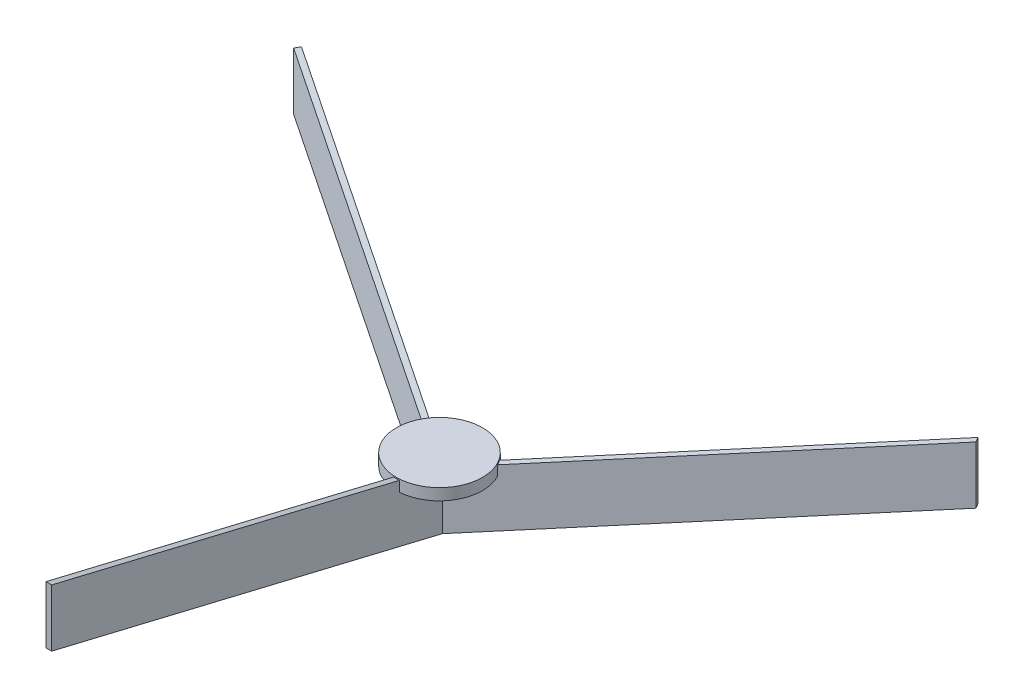
ISO-10303-21;
HEADER;
FILE_DESCRIPTION(('STEP AP214'),'2;1');
FILE_NAME('part.step','',(''),(''),'','','');
FILE_SCHEMA(('AUTOMOTIVE_DESIGN { 1 0 10303 214 1 1 1 1 }'));
ENDSEC;
DATA;
#1=APPLICATION_CONTEXT('core data for automotive mechanical design processes');
#2=APPLICATION_PROTOCOL_DEFINITION('international standard','automotive_design',2000,#1);
#3=PRODUCT_CONTEXT('',#1,'mechanical');
#4=PRODUCT('Part','Part','',(#3));
#5=PRODUCT_RELATED_PRODUCT_CATEGORY('part','',(#4));
#6=PRODUCT_DEFINITION_FORMATION('','',#4);
#7=PRODUCT_DEFINITION_CONTEXT('part definition',#1,'design');
#8=PRODUCT_DEFINITION('design','',#6,#7);
#9=PRODUCT_DEFINITION_SHAPE('','',#8);
#10=(LENGTH_UNIT() NAMED_UNIT(*) SI_UNIT(.MILLI.,.METRE.));
#11=(NAMED_UNIT(*) PLANE_ANGLE_UNIT() SI_UNIT($,.RADIAN.));
#12=(NAMED_UNIT(*) SI_UNIT($,.STERADIAN.) SOLID_ANGLE_UNIT());
#13=UNCERTAINTY_MEASURE_WITH_UNIT(LENGTH_MEASURE(1.E-05),#10,'distance_accuracy_value','');
#14=(GEOMETRIC_REPRESENTATION_CONTEXT(3) GLOBAL_UNCERTAINTY_ASSIGNED_CONTEXT((#13)) GLOBAL_UNIT_ASSIGNED_CONTEXT((#10,
#11,#12)) REPRESENTATION_CONTEXT('',''));
#15=CARTESIAN_POINT('',(0.,0.,0.));
#16=DIRECTION('',(0.,0.,1.));
#17=DIRECTION('',(1.,0.,0.));
#18=AXIS2_PLACEMENT_3D('',#15,#16,#17);
#19=CARTESIAN_POINT('',(-1.27,66.8153871254693,172.909241248834));
#20=DIRECTION('',(0.,0.972492920409641,-0.232932436026261));
#21=DIRECTION('',(0.,0.232932436026261,0.972492920409641));
#22=AXIS2_PLACEMENT_3D('',#19,#20,#21);
#23=PLANE('',#22);
#24=DIRECTION('',(0.,0.232932436026261,0.972492920409641));
#25=VECTOR('',#24,1.);
#26=CARTESIAN_POINT('',(1.27,66.8153871254693,172.909241248834));
#27=LINE('',#26,#25);
#28=CARTESIAN_POINT('',(1.27,29.9527232394758,19.0076195248116));
#29=VERTEX_POINT('',#28);
#30=CARTESIAN_POINT('',(1.27,66.8153871254693,172.909241248834));
#31=VERTEX_POINT('',#30);
#32=EDGE_CURVE('E197',#29,#31,#27,.T.);
#33=ORIENTED_EDGE('',*,*,#32,.F.);
#34=CARTESIAN_POINT('',(0.,25.4,0.));
#35=DIRECTION('',(0.,0.972492920409641,-0.232932436026261));
#36=DIRECTION('',(0.,-0.232932436026261,-0.972492920409641));
#37=AXIS2_PLACEMENT_3D('',#34,#35,#36);
#38=ELLIPSE('',#37,19.5888315484864,19.05);
#39=CARTESIAN_POINT('',(-1.27,29.9527232394758,19.0076195248116));
#40=VERTEX_POINT('',#39);
#41=EDGE_CURVE('E64',#29,#40,#38,.F.);
#42=ORIENTED_EDGE('',*,*,#41,.T.);
#43=DIRECTION('',(0.,0.232932436026261,0.972492920409641));
#44=VECTOR('',#43,1.);
#45=CARTESIAN_POINT('',(-1.27,66.8153871254693,172.909241248834));
#46=LINE('',#45,#44);
#47=CARTESIAN_POINT('',(-1.27,66.8153871254693,172.909241248834));
#48=VERTEX_POINT('',#47);
#49=EDGE_CURVE('E193',#40,#48,#46,.T.);
#50=ORIENTED_EDGE('',*,*,#49,.T.);
#51=DIRECTION('',(1.,0.,0.));
#52=VECTOR('',#51,1.);
#53=CARTESIAN_POINT('',(-1.27,66.8153871254693,172.909241248834));
#54=LINE('',#53,#52);
#55=EDGE_CURVE('E186',#48,#31,#54,.T.);
#56=ORIENTED_EDGE('',*,*,#55,.T.);
#57=EDGE_LOOP('',(#33,#42,#50,#56));
#58=FACE_BOUND('',#57,.T.);
#59=ADVANCED_FACE('F41',(#58),#23,.T.);
#60=CARTESIAN_POINT('',(-1.27,0.,0.));
#61=DIRECTION('',(-1.,0.,0.));
#62=DIRECTION('',(0.,0.,1.));
#63=AXIS2_PLACEMENT_3D('',#60,#61,#62);
#64=PLANE('',#63);
#65=ORIENTED_EDGE('',*,*,#49,.F.);
#66=DIRECTION('',(0.,-1.,0.));
#67=VECTOR('',#66,1.);
#68=CARTESIAN_POINT('',(-1.27,30.48,19.0076195248116));
#69=LINE('',#68,#67);
#70=CARTESIAN_POINT('',(-1.27,25.4,19.0076195248116));
#71=VERTEX_POINT('',#70);
#72=EDGE_CURVE('E56',#40,#71,#69,.T.);
#73=ORIENTED_EDGE('',*,*,#72,.T.);
#74=DIRECTION('',(0.,0.,-1.));
#75=VECTOR('',#74,1.);
#76=CARTESIAN_POINT('',(-1.27,25.4,0.));
#77=LINE('',#76,#75);
#78=CARTESIAN_POINT('',(-1.26999999999999,25.4,0.));
#79=VERTEX_POINT('',#78);
#80=EDGE_CURVE('E161',#71,#79,#77,.T.);
#81=ORIENTED_EDGE('',*,*,#80,.T.);
#82=DIRECTION('',(0.,-1.,0.));
#83=VECTOR('',#82,1.);
#84=CARTESIAN_POINT('',(-1.27,25.4,0.));
#85=LINE('',#84,#83);
#86=CARTESIAN_POINT('',(-1.27,0.,0.));
#87=VERTEX_POINT('',#86);
#88=EDGE_CURVE('E150',#79,#87,#85,.T.);
#89=ORIENTED_EDGE('',*,*,#88,.T.);
#90=DIRECTION('',(0.,-0.232932436026261,-0.972492920409641));
#91=VECTOR('',#90,1.);
#92=CARTESIAN_POINT('',(-1.27,0.,0.));
#93=LINE('',#92,#91);
#94=CARTESIAN_POINT('',(-1.27,41.4153871254692,172.909241248834));
#95=VERTEX_POINT('',#94);
#96=EDGE_CURVE('E189',#95,#87,#93,.T.);
#97=ORIENTED_EDGE('',*,*,#96,.F.);
#98=DIRECTION('',(0.,-1.,0.));
#99=VECTOR('',#98,1.);
#100=CARTESIAN_POINT('',(-1.27,41.4153871254692,172.909241248834));
#101=LINE('',#100,#99);
#102=EDGE_CURVE('E201',#48,#95,#101,.T.);
#103=ORIENTED_EDGE('',*,*,#102,.F.);
#104=EDGE_LOOP('',(#65,#73,#81,#89,#97,#103));
#105=FACE_BOUND('',#104,.T.);
#106=ADVANCED_FACE('F162',(#105),#64,.T.);
#107=CARTESIAN_POINT('',(1.27,0.,0.));
#108=DIRECTION('',(-1.,0.,0.));
#109=DIRECTION('',(0.,0.,1.));
#110=AXIS2_PLACEMENT_3D('',#107,#108,#109);
#111=PLANE('',#110);
#112=DIRECTION('',(0.,-1.,0.));
#113=VECTOR('',#112,1.);
#114=CARTESIAN_POINT('',(1.27,30.48,19.0076195248116));
#115=LINE('',#114,#113);
#116=CARTESIAN_POINT('',(1.27,25.4,19.0076195248116));
#117=VERTEX_POINT('',#116);
#118=EDGE_CURVE('E244',#29,#117,#115,.T.);
#119=ORIENTED_EDGE('',*,*,#118,.F.);
#120=ORIENTED_EDGE('',*,*,#32,.T.);
#121=DIRECTION('',(0.,-1.,0.));
#122=VECTOR('',#121,1.);
#123=CARTESIAN_POINT('',(1.27,41.4153871254692,172.909241248834));
#124=LINE('',#123,#122);
#125=CARTESIAN_POINT('',(1.27,41.4153871254692,172.909241248834));
#126=VERTEX_POINT('',#125);
#127=EDGE_CURVE('E194',#31,#126,#124,.T.);
#128=ORIENTED_EDGE('',*,*,#127,.T.);
#129=DIRECTION('',(0.,-0.232932436026261,-0.972492920409641));
#130=VECTOR('',#129,1.);
#131=CARTESIAN_POINT('',(1.27,0.,0.));
#132=LINE('',#131,#130);
#133=CARTESIAN_POINT('',(1.27,0.,0.));
#134=VERTEX_POINT('',#133);
#135=EDGE_CURVE('E191',#126,#134,#132,.T.);
#136=ORIENTED_EDGE('',*,*,#135,.T.);
#137=DIRECTION('',(0.,-1.,0.));
#138=VECTOR('',#137,1.);
#139=CARTESIAN_POINT('',(1.27,25.4,0.));
#140=LINE('',#139,#138);
#141=CARTESIAN_POINT('',(1.27,25.4,0.));
#142=VERTEX_POINT('',#141);
#143=EDGE_CURVE('E171',#142,#134,#140,.T.);
#144=ORIENTED_EDGE('',*,*,#143,.F.);
#145=DIRECTION('',(0.,0.,-1.));
#146=VECTOR('',#145,1.);
#147=CARTESIAN_POINT('',(1.27,25.4,0.));
#148=LINE('',#147,#146);
#149=EDGE_CURVE('E258',#117,#142,#148,.T.);
#150=ORIENTED_EDGE('',*,*,#149,.F.);
#151=EDGE_LOOP('',(#119,#120,#128,#136,#144,#150));
#152=FACE_BOUND('',#151,.T.);
#153=ADVANCED_FACE('F294',(#152),#111,.F.);
#154=CARTESIAN_POINT('',(151.013795470582,66.8153871254693,-86.4546206244177));
#155=DIRECTION('',(-0.201725406964135,0.972492920409641,0.116466218013132));
#156=DIRECTION('',(-0.979156418960265,-0.203107624694176,0.));
#157=AXIS2_PLACEMENT_3D('',#154,#155,#156);
#158=PLANE('',#157);
#159=DIRECTION('',(0.842203574075265,0.232932436026261,-0.486246460204824));
#160=VECTOR('',#159,1.);
#161=CARTESIAN_POINT('',(149.743795470582,66.8153871254693,-88.6543251500302));
#162=LINE('',#161,#160);
#163=CARTESIAN_POINT('',(15.4625877624824,29.6765648895988,-11.12703373265));
#164=VERTEX_POINT('',#163);
#165=CARTESIAN_POINT('',(149.743795470582,66.8153871254693,-88.6543251500302));
#166=VERTEX_POINT('',#165);
#167=EDGE_CURVE('E216',#164,#166,#162,.T.);
#168=ORIENTED_EDGE('',*,*,#167,.F.);
#169=CARTESIAN_POINT('',(0.,25.136562332262,0.));
#170=DIRECTION('',(-0.201725406964135,0.972492920409641,0.116466218013132));
#171=DIRECTION('',(-0.842203574075265,-0.232932436026261,0.486246460204824));
#172=AXIS2_PLACEMENT_3D('',#169,#170,#171);
#173=ELLIPSE('',#172,19.5888315484864,19.05);
#174=CARTESIAN_POINT('',(16.8061159592004,29.6969009490805,-8.9697807312057));
#175=VERTEX_POINT('',#174);
#176=EDGE_CURVE('E249',#164,#175,#173,.F.);
#177=ORIENTED_EDGE('',*,*,#176,.T.);
#178=DIRECTION('',(0.842203574075265,0.232932436026261,-0.486246460204824));
#179=VECTOR('',#178,1.);
#180=CARTESIAN_POINT('',(151.013795470582,66.8153871254693,-86.4546206244177));
#181=LINE('',#180,#179);
#182=CARTESIAN_POINT('',(151.013795470582,66.8153871254693,-86.4546206244177));
#183=VERTEX_POINT('',#182);
#184=EDGE_CURVE('E212',#175,#183,#181,.T.);
#185=ORIENTED_EDGE('',*,*,#184,.T.);
#186=DIRECTION('',(-0.500000000000004,0.,-0.866025403784436));
#187=VECTOR('',#186,1.);
#188=CARTESIAN_POINT('',(151.013795470582,66.8153871254693,-86.4546206244177));
#189=LINE('',#188,#187);
#190=EDGE_CURVE('E205',#183,#166,#189,.T.);
#191=ORIENTED_EDGE('',*,*,#190,.T.);
#192=EDGE_LOOP('',(#168,#177,#185,#191));
#193=FACE_BOUND('',#192,.T.);
#194=ADVANCED_FACE('F307',(#193),#158,.T.);
#195=CARTESIAN_POINT('',(1.27,0.,0.));
#196=DIRECTION('',(0.500000000000004,0.,0.866025403784436));
#197=DIRECTION('',(0.866025403784436,0.,-0.500000000000004));
#198=AXIS2_PLACEMENT_3D('',#195,#196,#197);
#199=PLANE('',#198);
#200=ORIENTED_EDGE('',*,*,#184,.F.);
#201=DIRECTION('',(0.,-1.,0.));
#202=VECTOR('',#201,1.);
#203=CARTESIAN_POINT('',(16.8061159592004,30.48,-8.9697807312057));
#204=LINE('',#203,#202);
#205=CARTESIAN_POINT('',(16.8061159592004,25.4,-8.9697807312057));
#206=VERTEX_POINT('',#205);
#207=EDGE_CURVE('E247',#175,#206,#204,.T.);
#208=ORIENTED_EDGE('',*,*,#207,.T.);
#209=DIRECTION('',(-0.866025403784436,0.,0.500000000000004));
#210=VECTOR('',#209,1.);
#211=CARTESIAN_POINT('',(1.27,25.4,0.));
#212=LINE('',#211,#210);
#213=EDGE_CURVE('E167',#206,#142,#212,.T.);
#214=ORIENTED_EDGE('',*,*,#213,.T.);
#215=ORIENTED_EDGE('',*,*,#143,.T.);
#216=DIRECTION('',(-0.842203574075265,-0.232932436026261,0.486246460204824));
#217=VECTOR('',#216,1.);
#218=CARTESIAN_POINT('',(1.27,0.,0.));
#219=LINE('',#218,#217);
#220=CARTESIAN_POINT('',(151.013795470582,41.4153871254692,-86.4546206244177));
#221=VERTEX_POINT('',#220);
#222=EDGE_CURVE('E208',#221,#134,#219,.T.);
#223=ORIENTED_EDGE('',*,*,#222,.F.);
#224=DIRECTION('',(0.,-1.,0.));
#225=VECTOR('',#224,1.);
#226=CARTESIAN_POINT('',(151.013795470582,41.4153871254692,-86.4546206244177));
#227=LINE('',#226,#225);
#228=EDGE_CURVE('E220',#183,#221,#227,.T.);
#229=ORIENTED_EDGE('',*,*,#228,.F.);
#230=EDGE_LOOP('',(#200,#208,#214,#215,#223,#229));
#231=FACE_BOUND('',#230,.T.);
#232=ADVANCED_FACE('F312',(#231),#199,.T.);
#233=CARTESIAN_POINT('',(0.,0.,-2.19970452561247));
#234=DIRECTION('',(0.500000000000004,0.,0.866025403784436));
#235=DIRECTION('',(0.866025403784436,0.,-0.500000000000004));
#236=AXIS2_PLACEMENT_3D('',#233,#234,#235);
#237=PLANE('',#236);
#238=DIRECTION('',(0.,-1.,0.));
#239=VECTOR('',#238,1.);
#240=CARTESIAN_POINT('',(15.4625877624824,30.48,-11.12703373265));
#241=LINE('',#240,#239);
#242=CARTESIAN_POINT('',(15.4625877624824,25.4,-11.12703373265));
#243=VERTEX_POINT('',#242);
#244=EDGE_CURVE('E251',#164,#243,#241,.T.);
#245=ORIENTED_EDGE('',*,*,#244,.F.);
#246=ORIENTED_EDGE('',*,*,#167,.T.);
#247=DIRECTION('',(0.,-1.,0.));
#248=VECTOR('',#247,1.);
#249=CARTESIAN_POINT('',(149.743795470582,41.4153871254692,-88.6543251500302));
#250=LINE('',#249,#248);
#251=CARTESIAN_POINT('',(149.743795470582,41.4153871254692,-88.6543251500302));
#252=VERTEX_POINT('',#251);
#253=EDGE_CURVE('E213',#166,#252,#250,.T.);
#254=ORIENTED_EDGE('',*,*,#253,.T.);
#255=DIRECTION('',(-0.842203574075265,-0.232932436026261,0.486246460204824));
#256=VECTOR('',#255,1.);
#257=CARTESIAN_POINT('',(0.,0.,-2.19970452561247));
#258=LINE('',#257,#256);
#259=CARTESIAN_POINT('',(0.,0.,-2.19970452561247));
#260=VERTEX_POINT('',#259);
#261=EDGE_CURVE('E210',#252,#260,#258,.T.);
#262=ORIENTED_EDGE('',*,*,#261,.T.);
#263=DIRECTION('',(0.,-1.,0.));
#264=VECTOR('',#263,1.);
#265=CARTESIAN_POINT('',(0.,25.4,-2.19970452561247));
#266=LINE('',#265,#264);
#267=CARTESIAN_POINT('',(0.,25.4,-2.19970452561247));
#268=VERTEX_POINT('',#267);
#269=EDGE_CURVE('E158',#268,#260,#266,.T.);
#270=ORIENTED_EDGE('',*,*,#269,.F.);
#271=DIRECTION('',(-0.866025403784436,0.,0.500000000000004));
#272=VECTOR('',#271,1.);
#273=CARTESIAN_POINT('',(0.,25.4,-2.19970452561247));
#274=LINE('',#273,#272);
#275=EDGE_CURVE('E263',#243,#268,#274,.T.);
#276=ORIENTED_EDGE('',*,*,#275,.F.);
#277=EDGE_LOOP('',(#245,#246,#254,#262,#270,#276));
#278=FACE_BOUND('',#277,.T.);
#279=ADVANCED_FACE('F322',(#278),#237,.F.);
#280=CARTESIAN_POINT('',(-149.743795470583,66.8153871254693,-88.6543251500281));
#281=DIRECTION('',(0.201725406964137,0.972492920409641,0.116466218013129));
#282=DIRECTION('',(-0.979156418960264,0.203107624694178,0.));
#283=AXIS2_PLACEMENT_3D('',#280,#281,#282);
#284=PLANE('',#283);
#285=DIRECTION('',(-0.842203574075272,0.232932436026261,-0.486246460204813));
#286=VECTOR('',#285,1.);
#287=CARTESIAN_POINT('',(-151.013795470583,66.8153871254693,-86.4546206244156));
#288=LINE('',#287,#286);
#289=CARTESIAN_POINT('',(-16.8061159592005,29.6969009490805,-8.96978073120548));
#290=VERTEX_POINT('',#289);
#291=CARTESIAN_POINT('',(-151.013795470583,66.8153871254693,-86.4546206244156));
#292=VERTEX_POINT('',#291);
#293=EDGE_CURVE('E234',#290,#292,#288,.T.);
#294=ORIENTED_EDGE('',*,*,#293,.F.);
#295=CARTESIAN_POINT('',(0.,25.136562332262,0.));
#296=DIRECTION('',(0.201725406964137,0.972492920409641,0.116466218013129));
#297=DIRECTION('',(0.842203574075271,-0.232932436026261,0.486246460204813));
#298=AXIS2_PLACEMENT_3D('',#295,#296,#297);
#299=ELLIPSE('',#298,19.5888315484864,19.05);
#300=CARTESIAN_POINT('',(-15.4625877624825,29.6765648895988,-11.1270337326498));
#301=VERTEX_POINT('',#300);
#302=EDGE_CURVE('E166',#290,#301,#299,.F.);
#303=ORIENTED_EDGE('',*,*,#302,.T.);
#304=DIRECTION('',(-0.842203574075272,0.232932436026261,-0.486246460204813));
#305=VECTOR('',#304,1.);
#306=CARTESIAN_POINT('',(-149.743795470583,66.8153871254693,-88.6543251500281));
#307=LINE('',#306,#305);
#308=CARTESIAN_POINT('',(-149.743795470583,66.8153871254693,-88.6543251500281));
#309=VERTEX_POINT('',#308);
#310=EDGE_CURVE('E224',#301,#309,#307,.T.);
#311=ORIENTED_EDGE('',*,*,#310,.T.);
#312=DIRECTION('',(-0.499999999999992,0.,0.866025403784443));
#313=VECTOR('',#312,1.);
#314=CARTESIAN_POINT('',(-149.743795470583,66.8153871254693,-88.6543251500281));
#315=LINE('',#314,#313);
#316=EDGE_CURVE('E226',#309,#292,#315,.T.);
#317=ORIENTED_EDGE('',*,*,#316,.T.);
#318=EDGE_LOOP('',(#294,#303,#311,#317));
#319=FACE_BOUND('',#318,.T.);
#320=ADVANCED_FACE('F325',(#319),#284,.T.);
#321=CARTESIAN_POINT('',(0.,0.,-2.19970452561247));
#322=DIRECTION('',(0.499999999999992,0.,-0.866025403784443));
#323=DIRECTION('',(-0.866025403784443,0.,-0.499999999999992));
#324=AXIS2_PLACEMENT_3D('',#321,#322,#323);
#325=PLANE('',#324);
#326=ORIENTED_EDGE('',*,*,#310,.F.);
#327=DIRECTION('',(0.,-1.,0.));
#328=VECTOR('',#327,1.);
#329=CARTESIAN_POINT('',(-15.4625877624825,30.48,-11.1270337326498));
#330=LINE('',#329,#328);
#331=CARTESIAN_POINT('',(-15.4625877624825,25.4,-11.1270337326498));
#332=VERTEX_POINT('',#331);
#333=EDGE_CURVE('E254',#301,#332,#330,.T.);
#334=ORIENTED_EDGE('',*,*,#333,.T.);
#335=DIRECTION('',(0.866025403784443,0.,0.499999999999992));
#336=VECTOR('',#335,1.);
#337=CARTESIAN_POINT('',(0.,25.4,-2.19970452561247));
#338=LINE('',#337,#336);
#339=EDGE_CURVE('E261',#332,#268,#338,.T.);
#340=ORIENTED_EDGE('',*,*,#339,.T.);
#341=ORIENTED_EDGE('',*,*,#269,.T.);
#342=DIRECTION('',(0.842203574075272,-0.232932436026261,0.486246460204813));
#343=VECTOR('',#342,1.);
#344=CARTESIAN_POINT('',(0.,0.,-2.19970452561247));
#345=LINE('',#344,#343);
#346=CARTESIAN_POINT('',(-149.743795470583,41.4153871254692,-88.6543251500281));
#347=VERTEX_POINT('',#346);
#348=EDGE_CURVE('E231',#347,#260,#345,.T.);
#349=ORIENTED_EDGE('',*,*,#348,.F.);
#350=DIRECTION('',(0.,-1.,0.));
#351=VECTOR('',#350,1.);
#352=CARTESIAN_POINT('',(-149.743795470583,41.4153871254692,-88.6543251500281));
#353=LINE('',#352,#351);
#354=EDGE_CURVE('E228',#309,#347,#353,.T.);
#355=ORIENTED_EDGE('',*,*,#354,.F.);
#356=EDGE_LOOP('',(#326,#334,#340,#341,#349,#355));
#357=FACE_BOUND('',#356,.T.);
#358=ADVANCED_FACE('F330',(#357),#325,.T.);
#359=CARTESIAN_POINT('',(-1.26999999999999,0.,0.));
#360=DIRECTION('',(0.499999999999992,0.,-0.866025403784443));
#361=DIRECTION('',(-0.866025403784443,0.,-0.499999999999992));
#362=AXIS2_PLACEMENT_3D('',#359,#360,#361);
#363=PLANE('',#362);
#364=DIRECTION('',(0.,-1.,0.));
#365=VECTOR('',#364,1.);
#366=CARTESIAN_POINT('',(-16.8061159592005,30.48,-8.96978073120547));
#367=LINE('',#366,#365);
#368=CARTESIAN_POINT('',(-16.8061159592005,25.4,-8.96978073120547));
#369=VERTEX_POINT('',#368);
#370=EDGE_CURVE('E11',#290,#369,#367,.T.);
#371=ORIENTED_EDGE('',*,*,#370,.F.);
#372=ORIENTED_EDGE('',*,*,#293,.T.);
#373=DIRECTION('',(0.,-1.,0.));
#374=VECTOR('',#373,1.);
#375=CARTESIAN_POINT('',(-151.013795470583,41.4153871254692,-86.4546206244156));
#376=LINE('',#375,#374);
#377=CARTESIAN_POINT('',(-151.013795470583,41.4153871254692,-86.4546206244156));
#378=VERTEX_POINT('',#377);
#379=EDGE_CURVE('E236',#292,#378,#376,.T.);
#380=ORIENTED_EDGE('',*,*,#379,.T.);
#381=DIRECTION('',(0.842203574075272,-0.232932436026261,0.486246460204813));
#382=VECTOR('',#381,1.);
#383=CARTESIAN_POINT('',(-1.26999999999999,0.,0.));
#384=LINE('',#383,#382);
#385=EDGE_CURVE('E155',#378,#87,#384,.T.);
#386=ORIENTED_EDGE('',*,*,#385,.T.);
#387=ORIENTED_EDGE('',*,*,#88,.F.);
#388=DIRECTION('',(0.866025403784443,0.,0.499999999999992));
#389=VECTOR('',#388,1.);
#390=CARTESIAN_POINT('',(-1.26999999999999,25.4,0.));
#391=LINE('',#390,#389);
#392=EDGE_CURVE('E49',#369,#79,#391,.T.);
#393=ORIENTED_EDGE('',*,*,#392,.F.);
#394=EDGE_LOOP('',(#371,#372,#380,#386,#387,#393));
#395=FACE_BOUND('',#394,.T.);
#396=ADVANCED_FACE('F151',(#395),#363,.F.);
#397=CARTESIAN_POINT('',(0.,0.,0.));
#398=DIRECTION('',(0.,-1.,0.));
#399=DIRECTION('',(0.,0.,-1.));
#400=AXIS2_PLACEMENT_3D('',#397,#398,#399);
#401=PLANE('',#400);
#402=DIRECTION('',(1.,0.,0.));
#403=VECTOR('',#402,1.);
#404=CARTESIAN_POINT('',(1.27,0.,0.));
#405=LINE('',#404,#403);
#406=EDGE_CURVE('E182',#87,#134,#405,.T.);
#407=ORIENTED_EDGE('',*,*,#406,.F.);
#408=DIRECTION('',(-0.5,0.,0.866025403784439));
#409=VECTOR('',#408,1.);
#410=CARTESIAN_POINT('',(-1.27,0.,0.));
#411=LINE('',#410,#409);
#412=EDGE_CURVE('E159',#260,#87,#411,.T.);
#413=ORIENTED_EDGE('',*,*,#412,.F.);
#414=DIRECTION('',(-0.5,0.,-0.866025403784439));
#415=VECTOR('',#414,1.);
#416=CARTESIAN_POINT('',(0.,0.,-2.19970452561247));
#417=LINE('',#416,#415);
#418=EDGE_CURVE('E179',#134,#260,#417,.T.);
#419=ORIENTED_EDGE('',*,*,#418,.F.);
#420=EDGE_LOOP('',(#407,#413,#419));
#421=FACE_BOUND('',#420,.T.);
#422=ADVANCED_FACE('F43',(#421),#401,.T.);
#423=CARTESIAN_POINT('',(-1.27,0.,0.));
#424=DIRECTION('',(0.,-0.972492920409641,0.232932436026261));
#425=DIRECTION('',(0.,-0.232932436026261,-0.972492920409641));
#426=AXIS2_PLACEMENT_3D('',#423,#424,#425);
#427=PLANE('',#426);
#428=ORIENTED_EDGE('',*,*,#135,.F.);
#429=DIRECTION('',(1.,0.,0.));
#430=VECTOR('',#429,1.);
#431=CARTESIAN_POINT('',(-1.27,41.4153871254692,172.909241248834));
#432=LINE('',#431,#430);
#433=EDGE_CURVE('E185',#95,#126,#432,.T.);
#434=ORIENTED_EDGE('',*,*,#433,.F.);
#435=ORIENTED_EDGE('',*,*,#96,.T.);
#436=ORIENTED_EDGE('',*,*,#406,.T.);
#437=EDGE_LOOP('',(#428,#434,#435,#436));
#438=FACE_BOUND('',#437,.T.);
#439=ADVANCED_FACE('F301',(#438),#427,.T.);
#440=CARTESIAN_POINT('',(-1.27,41.4153871254692,172.909241248834));
#441=DIRECTION('',(0.,0.,1.));
#442=DIRECTION('',(1.,0.,0.));
#443=AXIS2_PLACEMENT_3D('',#440,#441,#442);
#444=PLANE('',#443);
#445=ORIENTED_EDGE('',*,*,#127,.F.);
#446=ORIENTED_EDGE('',*,*,#55,.F.);
#447=ORIENTED_EDGE('',*,*,#102,.T.);
#448=ORIENTED_EDGE('',*,*,#433,.T.);
#449=EDGE_LOOP('',(#445,#446,#447,#448));
#450=FACE_BOUND('',#449,.T.);
#451=ADVANCED_FACE('F297',(#450),#444,.T.);
#452=CARTESIAN_POINT('',(1.27,0.,0.));
#453=DIRECTION('',(0.201725406964135,-0.972492920409641,-0.116466218013131));
#454=DIRECTION('',(0.979156418960265,0.203107624694176,0.));
#455=AXIS2_PLACEMENT_3D('',#452,#453,#454);
#456=PLANE('',#455);
#457=ORIENTED_EDGE('',*,*,#261,.F.);
#458=DIRECTION('',(-0.500000000000004,0.,-0.866025403784436));
#459=VECTOR('',#458,1.);
#460=CARTESIAN_POINT('',(151.013795470582,41.4153871254692,-86.4546206244177));
#461=LINE('',#460,#459);
#462=EDGE_CURVE('E199',#221,#252,#461,.T.);
#463=ORIENTED_EDGE('',*,*,#462,.F.);
#464=ORIENTED_EDGE('',*,*,#222,.T.);
#465=ORIENTED_EDGE('',*,*,#418,.T.);
#466=EDGE_LOOP('',(#457,#463,#464,#465));
#467=FACE_BOUND('',#466,.T.);
#468=ADVANCED_FACE('F300',(#467),#456,.T.);
#469=CARTESIAN_POINT('',(151.013795470582,41.4153871254692,-86.4546206244177));
#470=DIRECTION('',(0.866025403784436,0.,-0.500000000000004));
#471=DIRECTION('',(-0.500000000000004,0.,-0.866025403784436));
#472=AXIS2_PLACEMENT_3D('',#469,#470,#471);
#473=PLANE('',#472);
#474=ORIENTED_EDGE('',*,*,#253,.F.);
#475=ORIENTED_EDGE('',*,*,#190,.F.);
#476=ORIENTED_EDGE('',*,*,#228,.T.);
#477=ORIENTED_EDGE('',*,*,#462,.T.);
#478=EDGE_LOOP('',(#474,#475,#476,#477));
#479=FACE_BOUND('',#478,.T.);
#480=ADVANCED_FACE('F314',(#479),#473,.T.);
#481=CARTESIAN_POINT('',(0.,0.,-2.19970452561247));
#482=DIRECTION('',(-0.201725406964137,-0.972492920409641,-0.116466218013129));
#483=DIRECTION('',(0.979156418960264,-0.203107624694178,0.));
#484=AXIS2_PLACEMENT_3D('',#481,#482,#483);
#485=PLANE('',#484);
#486=ORIENTED_EDGE('',*,*,#385,.F.);
#487=DIRECTION('',(-0.499999999999992,0.,0.866025403784443));
#488=VECTOR('',#487,1.);
#489=CARTESIAN_POINT('',(-149.743795470583,41.4153871254692,-88.6543251500281));
#490=LINE('',#489,#488);
#491=EDGE_CURVE('E227',#347,#378,#490,.T.);
#492=ORIENTED_EDGE('',*,*,#491,.F.);
#493=ORIENTED_EDGE('',*,*,#348,.T.);
#494=ORIENTED_EDGE('',*,*,#412,.T.);
#495=EDGE_LOOP('',(#486,#492,#493,#494));
#496=FACE_BOUND('',#495,.T.);
#497=ADVANCED_FACE('F317',(#496),#485,.T.);
#498=CARTESIAN_POINT('',(-149.743795470583,41.4153871254692,-88.6543251500281));
#499=DIRECTION('',(-0.866025403784443,0.,-0.499999999999992));
#500=DIRECTION('',(-0.499999999999992,0.,0.866025403784443));
#501=AXIS2_PLACEMENT_3D('',#498,#499,#500);
#502=PLANE('',#501);
#503=ORIENTED_EDGE('',*,*,#379,.F.);
#504=ORIENTED_EDGE('',*,*,#316,.F.);
#505=ORIENTED_EDGE('',*,*,#354,.T.);
#506=ORIENTED_EDGE('',*,*,#491,.T.);
#507=EDGE_LOOP('',(#503,#504,#505,#506));
#508=FACE_BOUND('',#507,.T.);
#509=ADVANCED_FACE('F338',(#508),#502,.T.);
#510=CARTESIAN_POINT('',(0.,25.4,0.));
#511=DIRECTION('',(0.,1.,0.));
#512=DIRECTION('',(0.,0.,1.));
#513=AXIS2_PLACEMENT_3D('',#510,#511,#512);
#514=PLANE('',#513);
#515=ORIENTED_EDGE('',*,*,#80,.F.);
#516=CARTESIAN_POINT('',(0.,25.4,0.));
#517=DIRECTION('',(0.,1.,0.));
#518=DIRECTION('',(0.,0.,1.));
#519=AXIS2_PLACEMENT_3D('',#516,#517,#518);
#520=CIRCLE('',#519,19.05);
#521=EDGE_CURVE('E170',#369,#71,#520,.T.);
#522=ORIENTED_EDGE('',*,*,#521,.F.);
#523=ORIENTED_EDGE('',*,*,#392,.T.);
#524=EDGE_LOOP('',(#515,#522,#523));
#525=FACE_BOUND('',#524,.T.);
#526=ADVANCED_FACE('F169',(#525),#514,.F.);
#527=ORIENTED_EDGE('',*,*,#213,.F.);
#528=EDGE_CURVE('E267',#117,#206,#520,.T.);
#529=ORIENTED_EDGE('',*,*,#528,.F.);
#530=ORIENTED_EDGE('',*,*,#149,.T.);
#531=EDGE_LOOP('',(#527,#529,#530));
#532=FACE_BOUND('',#531,.T.);
#533=ADVANCED_FACE('F286',(#532),#514,.F.);
#534=ORIENTED_EDGE('',*,*,#339,.F.);
#535=EDGE_CURVE('E270',#243,#332,#520,.T.);
#536=ORIENTED_EDGE('',*,*,#535,.F.);
#537=ORIENTED_EDGE('',*,*,#275,.T.);
#538=EDGE_LOOP('',(#534,#536,#537));
#539=FACE_BOUND('',#538,.T.);
#540=ADVANCED_FACE('F278',(#539),#514,.F.);
#541=CARTESIAN_POINT('',(0.,30.48,0.));
#542=DIRECTION('',(0.,-1.,0.));
#543=DIRECTION('',(0.,0.,-1.));
#544=AXIS2_PLACEMENT_3D('',#541,#542,#543);
#545=CYLINDRICAL_SURFACE('',#544,19.05);
#546=ORIENTED_EDGE('',*,*,#72,.F.);
#547=ORIENTED_EDGE('',*,*,#41,.F.);
#548=ORIENTED_EDGE('',*,*,#118,.T.);
#549=ORIENTED_EDGE('',*,*,#528,.T.);
#550=ORIENTED_EDGE('',*,*,#207,.F.);
#551=ORIENTED_EDGE('',*,*,#176,.F.);
#552=ORIENTED_EDGE('',*,*,#244,.T.);
#553=ORIENTED_EDGE('',*,*,#535,.T.);
#554=ORIENTED_EDGE('',*,*,#333,.F.);
#555=ORIENTED_EDGE('',*,*,#302,.F.);
#556=ORIENTED_EDGE('',*,*,#370,.T.);
#557=ORIENTED_EDGE('',*,*,#521,.T.);
#558=EDGE_LOOP('',(#546,#547,#548,#549,#550,#551,#552,#553,#554,#555,#556,#557));
#559=FACE_BOUND('',#558,.T.);
#560=CARTESIAN_POINT('',(0.,30.48,0.));
#561=DIRECTION('',(0.,1.,0.));
#562=DIRECTION('',(0.,0.,1.));
#563=AXIS2_PLACEMENT_3D('',#560,#561,#562);
#564=CIRCLE('',#563,19.05);
#565=CARTESIAN_POINT('',(0.,30.48,19.05));
#566=VERTEX_POINT('',#565);
#567=EDGE_CURVE('E266',#566,#566,#564,.T.);
#568=ORIENTED_EDGE('',*,*,#567,.F.);
#569=EDGE_LOOP('',(#568));
#570=FACE_BOUND('',#569,.T.);
#571=ADVANCED_FACE('F276',(#559,#570),#545,.T.);
#572=CARTESIAN_POINT('',(0.,30.48,0.));
#573=DIRECTION('',(0.,1.,0.));
#574=DIRECTION('',(0.,0.,1.));
#575=AXIS2_PLACEMENT_3D('',#572,#573,#574);
#576=PLANE('',#575);
#577=ORIENTED_EDGE('',*,*,#567,.T.);
#578=EDGE_LOOP('',(#577));
#579=FACE_BOUND('',#578,.T.);
#580=ADVANCED_FACE('F274',(#579),#576,.T.);
#581=CLOSED_SHELL('',(#59,#106,#153,#194,#232,#279,#320,#358,#396,#422,#439,#451,#468,#480,#497,
#509,#526,#533,#540,#571,#580));
#582=MANIFOLD_SOLID_BREP('B2',#581);
#583=ADVANCED_BREP_SHAPE_REPRESENTATION('',(#18,#582),#14);
#584=SHAPE_DEFINITION_REPRESENTATION(#9,#583);
ENDSEC;
END-ISO-10303-21;
